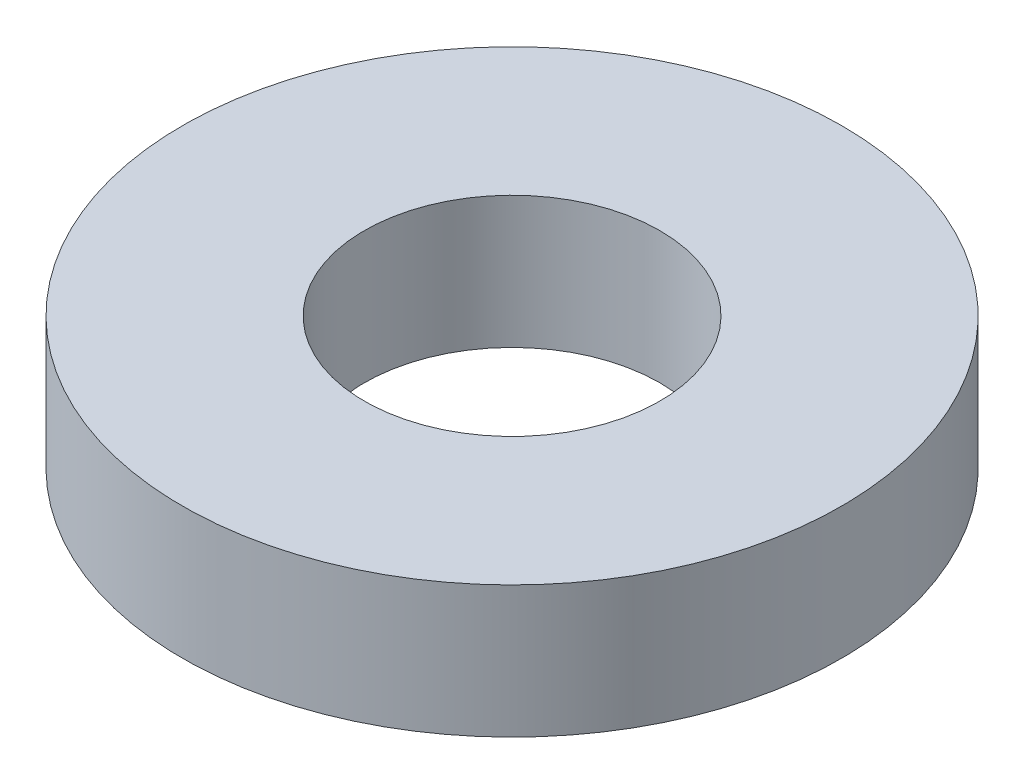
ISO-10303-21;
HEADER;
FILE_DESCRIPTION(('STEP AP214'),'2;1');
FILE_NAME('part.step','',(''),(''),'','','');
FILE_SCHEMA(('AUTOMOTIVE_DESIGN { 1 0 10303 214 1 1 1 1 }'));
ENDSEC;
DATA;
#1=APPLICATION_CONTEXT('core data for automotive mechanical design processes');
#2=APPLICATION_PROTOCOL_DEFINITION('international standard','automotive_design',2000,#1);
#3=PRODUCT_CONTEXT('',#1,'mechanical');
#4=PRODUCT('Part','Part','',(#3));
#5=PRODUCT_RELATED_PRODUCT_CATEGORY('part','',(#4));
#6=PRODUCT_DEFINITION_FORMATION('','',#4);
#7=PRODUCT_DEFINITION_CONTEXT('part definition',#1,'design');
#8=PRODUCT_DEFINITION('design','',#6,#7);
#9=PRODUCT_DEFINITION_SHAPE('','',#8);
#10=(LENGTH_UNIT() NAMED_UNIT(*) SI_UNIT(.MILLI.,.METRE.));
#11=(NAMED_UNIT(*) PLANE_ANGLE_UNIT() SI_UNIT($,.RADIAN.));
#12=(NAMED_UNIT(*) SI_UNIT($,.STERADIAN.) SOLID_ANGLE_UNIT());
#13=UNCERTAINTY_MEASURE_WITH_UNIT(LENGTH_MEASURE(1.E-05),#10,'distance_accuracy_value','');
#14=(GEOMETRIC_REPRESENTATION_CONTEXT(3) GLOBAL_UNCERTAINTY_ASSIGNED_CONTEXT((#13)) GLOBAL_UNIT_ASSIGNED_CONTEXT((#10,
#11,#12)) REPRESENTATION_CONTEXT('',''));
#15=CARTESIAN_POINT('',(0.,0.,0.));
#16=DIRECTION('',(0.,0.,1.));
#17=DIRECTION('',(1.,0.,0.));
#18=AXIS2_PLACEMENT_3D('',#15,#16,#17);
#19=CARTESIAN_POINT('',(0.,29.,0.));
#20=DIRECTION('',(0.,-1.,0.));
#21=DIRECTION('',(0.,0.,-1.));
#22=AXIS2_PLACEMENT_3D('',#19,#20,#21);
#23=CYLINDRICAL_SURFACE('',#22,72.5);
#24=CARTESIAN_POINT('',(0.,29.,0.));
#25=DIRECTION('',(0.,1.,0.));
#26=DIRECTION('',(0.,0.,1.));
#27=AXIS2_PLACEMENT_3D('',#24,#25,#26);
#28=CIRCLE('',#27,72.5);
#29=CARTESIAN_POINT('',(0.,29.,-72.5));
#30=VERTEX_POINT('',#29);
#31=EDGE_CURVE('E10',#30,#30,#28,.T.);
#32=CARTESIAN_POINT('',(0.,0.,0.));
#33=DIRECTION('',(0.,1.,0.));
#34=DIRECTION('',(0.,0.,1.));
#35=AXIS2_PLACEMENT_3D('',#32,#33,#34);
#36=CIRCLE('',#35,72.5);
#37=CARTESIAN_POINT('',(0.,0.,-72.5));
#38=VERTEX_POINT('',#37);
#39=EDGE_CURVE('E37',#38,#38,#36,.T.);
#40=CARTESIAN_POINT('',(0.,29.,-72.5));
#41=CARTESIAN_POINT('',(0.,28.6979166666667,-72.5));
#42=CARTESIAN_POINT('',(0.,28.3958333333333,-72.5));
#43=CARTESIAN_POINT('',(0.,27.7916666666667,-72.5));
#44=CARTESIAN_POINT('',(0.,27.4895833333333,-72.5));
#45=CARTESIAN_POINT('',(0.,26.8854166666667,-72.5));
#46=CARTESIAN_POINT('',(0.,26.5833333333333,-72.5));
#47=CARTESIAN_POINT('',(0.,25.9791666666667,-72.5));
#48=CARTESIAN_POINT('',(0.,25.6770833333333,-72.5));
#49=CARTESIAN_POINT('',(0.,25.0729166666667,-72.5));
#50=CARTESIAN_POINT('',(0.,24.7708333333333,-72.5));
#51=CARTESIAN_POINT('',(0.,24.1666666666667,-72.5));
#52=CARTESIAN_POINT('',(0.,23.8645833333333,-72.5));
#53=CARTESIAN_POINT('',(0.,23.2604166666667,-72.5));
#54=CARTESIAN_POINT('',(0.,22.9583333333333,-72.5));
#55=CARTESIAN_POINT('',(0.,22.3541666666667,-72.5));
#56=CARTESIAN_POINT('',(0.,22.0520833333333,-72.5));
#57=CARTESIAN_POINT('',(0.,21.4479166666667,-72.5));
#58=CARTESIAN_POINT('',(0.,21.1458333333333,-72.5));
#59=CARTESIAN_POINT('',(0.,20.5416666666667,-72.5));
#60=CARTESIAN_POINT('',(0.,20.2395833333333,-72.5));
#61=CARTESIAN_POINT('',(0.,19.6354166666667,-72.5));
#62=CARTESIAN_POINT('',(0.,19.3333333333333,-72.5));
#63=CARTESIAN_POINT('',(0.,18.7291666666667,-72.5));
#64=CARTESIAN_POINT('',(0.,18.4270833333333,-72.5));
#65=CARTESIAN_POINT('',(0.,17.8229166666667,-72.5));
#66=CARTESIAN_POINT('',(0.,17.5208333333333,-72.5));
#67=CARTESIAN_POINT('',(0.,16.9166666666667,-72.5));
#68=CARTESIAN_POINT('',(0.,16.6145833333333,-72.5));
#69=CARTESIAN_POINT('',(0.,16.0104166666667,-72.5));
#70=CARTESIAN_POINT('',(0.,15.7083333333333,-72.5));
#71=CARTESIAN_POINT('',(0.,15.1041666666667,-72.5));
#72=CARTESIAN_POINT('',(0.,14.8020833333333,-72.5));
#73=CARTESIAN_POINT('',(0.,14.1979166666667,-72.5));
#74=CARTESIAN_POINT('',(0.,13.8958333333333,-72.5));
#75=CARTESIAN_POINT('',(0.,13.2916666666667,-72.5));
#76=CARTESIAN_POINT('',(0.,12.9895833333333,-72.5));
#77=CARTESIAN_POINT('',(0.,12.3854166666667,-72.5));
#78=CARTESIAN_POINT('',(0.,12.0833333333333,-72.5));
#79=CARTESIAN_POINT('',(0.,11.4791666666667,-72.5));
#80=CARTESIAN_POINT('',(0.,11.1770833333333,-72.5));
#81=CARTESIAN_POINT('',(0.,10.5729166666667,-72.5));
#82=CARTESIAN_POINT('',(0.,10.2708333333333,-72.5));
#83=CARTESIAN_POINT('',(0.,9.66666666666667,-72.5));
#84=CARTESIAN_POINT('',(0.,9.36458333333333,-72.5));
#85=CARTESIAN_POINT('',(0.,8.76041666666667,-72.5));
#86=CARTESIAN_POINT('',(0.,8.45833333333333,-72.5));
#87=CARTESIAN_POINT('',(0.,7.85416666666667,-72.5));
#88=CARTESIAN_POINT('',(0.,7.55208333333333,-72.5));
#89=CARTESIAN_POINT('',(0.,6.94791666666667,-72.5));
#90=CARTESIAN_POINT('',(0.,6.64583333333333,-72.5));
#91=CARTESIAN_POINT('',(0.,6.04166666666667,-72.5));
#92=CARTESIAN_POINT('',(0.,5.73958333333333,-72.5));
#93=CARTESIAN_POINT('',(0.,5.13541666666667,-72.5));
#94=CARTESIAN_POINT('',(0.,4.83333333333333,-72.5));
#95=CARTESIAN_POINT('',(0.,4.22916666666667,-72.5));
#96=CARTESIAN_POINT('',(0.,3.92708333333333,-72.5));
#97=CARTESIAN_POINT('',(0.,3.32291666666667,-72.5));
#98=CARTESIAN_POINT('',(0.,3.02083333333333,-72.5));
#99=CARTESIAN_POINT('',(0.,2.41666666666667,-72.5));
#100=CARTESIAN_POINT('',(0.,2.11458333333333,-72.5));
#101=CARTESIAN_POINT('',(0.,1.51041666666667,-72.5));
#102=CARTESIAN_POINT('',(0.,1.20833333333333,-72.5));
#103=CARTESIAN_POINT('',(0.,0.604166666666667,-72.5));
#104=CARTESIAN_POINT('',(0.,0.302083333333333,-72.5));
#105=CARTESIAN_POINT('',(0.,0.,-72.5));
#106=B_SPLINE_CURVE_WITH_KNOTS('',3,(#40,#41,#42,#43,#44,#45,#46,#47,#48,#49,#50,#51,#52,#53,
#54,#55,#56,#57,#58,#59,#60,#61,#62,#63,#64,#65,#66,#67,#68,#69,#70,#71,#72,#73,#74,#75,#76,#77,
#78,#79,#80,#81,#82,#83,#84,#85,#86,#87,#88,#89,#90,#91,#92,#93,#94,#95,#96,#97,#98,#99,#100,
#101,#102,#103,#104,#105),.UNSPECIFIED.,.F.,.F.,(4,2,2,2,2,2,2,2,2,2,2,2,2,2,2,2,2,2,2,2,2,2,2,
2,2,2,2,2,2,2,2,2,4),(0.,0.906249999999997,1.8125,2.71875,3.625,4.53125,5.4375,6.34375,7.25,
8.15625,9.0625,9.96875,10.875,11.78125,12.6875,13.59375,14.5,15.40625,16.3125,17.21875,18.125,
19.03125,19.9375,20.84375,21.75,22.65625,23.5625,24.46875,25.375,26.28125,27.1875,28.09375,29.),.UNSPECIFIED.);
#107=EDGE_CURVE('BSEAM40',#30,#38,#106,.T.);
#108=ORIENTED_EDGE('',*,*,#31,.F.);
#109=ORIENTED_EDGE('',*,*,#39,.T.);
#110=ORIENTED_EDGE('',*,*,#107,.T.);
#111=ORIENTED_EDGE('',*,*,#107,.F.);
#112=EDGE_LOOP('',(#108,#110,#109,#111));
#113=FACE_BOUND('',#112,.T.);
#114=ADVANCED_FACE('F40',(#113),#23,.T.);
#115=CARTESIAN_POINT('',(0.,29.,0.));
#116=DIRECTION('',(0.,1.,0.));
#117=DIRECTION('',(0.,0.,1.));
#118=AXIS2_PLACEMENT_3D('',#115,#116,#117);
#119=PLANE('',#118);
#120=CARTESIAN_POINT('',(0.,29.,0.));
#121=DIRECTION('',(0.,1.,0.));
#122=DIRECTION('',(0.,0.,1.));
#123=AXIS2_PLACEMENT_3D('',#120,#121,#122);
#124=CIRCLE('',#123,32.5);
#125=CARTESIAN_POINT('',(0.,29.,-32.5));
#126=VERTEX_POINT('',#125);
#127=EDGE_CURVE('E50',#126,#126,#124,.T.);
#128=ORIENTED_EDGE('',*,*,#127,.F.);
#129=EDGE_LOOP('',(#128));
#130=FACE_BOUND('',#129,.T.);
#131=ORIENTED_EDGE('',*,*,#31,.T.);
#132=EDGE_LOOP('',(#131));
#133=FACE_BOUND('',#132,.T.);
#134=ADVANCED_FACE('F59',(#130,#133),#119,.T.);
#135=CARTESIAN_POINT('',(0.,0.,0.));
#136=DIRECTION('',(0.,1.,0.));
#137=DIRECTION('',(0.,0.,1.));
#138=AXIS2_PLACEMENT_3D('',#135,#136,#137);
#139=PLANE('',#138);
#140=CARTESIAN_POINT('',(0.,0.,0.));
#141=DIRECTION('',(0.,1.,0.));
#142=DIRECTION('',(0.,0.,1.));
#143=AXIS2_PLACEMENT_3D('',#140,#141,#142);
#144=CIRCLE('',#143,32.5);
#145=CARTESIAN_POINT('',(0.,0.,-32.5));
#146=VERTEX_POINT('',#145);
#147=EDGE_CURVE('E47',#146,#146,#144,.T.);
#148=ORIENTED_EDGE('',*,*,#147,.T.);
#149=EDGE_LOOP('',(#148));
#150=FACE_BOUND('',#149,.T.);
#151=ORIENTED_EDGE('',*,*,#39,.F.);
#152=EDGE_LOOP('',(#151));
#153=FACE_BOUND('',#152,.T.);
#154=ADVANCED_FACE('F58',(#150,#153),#139,.F.);
#155=CARTESIAN_POINT('',(0.,29.,0.));
#156=DIRECTION('',(0.,-1.,0.));
#157=DIRECTION('',(0.,0.,-1.));
#158=AXIS2_PLACEMENT_3D('',#155,#156,#157);
#159=CYLINDRICAL_SURFACE('',#158,32.5);
#160=CARTESIAN_POINT('',(0.,29.,-32.5));
#161=CARTESIAN_POINT('',(0.,28.6979166666667,-32.5));
#162=CARTESIAN_POINT('',(0.,28.3958333333333,-32.5));
#163=CARTESIAN_POINT('',(0.,27.7916666666667,-32.5));
#164=CARTESIAN_POINT('',(0.,27.4895833333333,-32.5));
#165=CARTESIAN_POINT('',(0.,26.8854166666667,-32.5));
#166=CARTESIAN_POINT('',(0.,26.5833333333333,-32.5));
#167=CARTESIAN_POINT('',(0.,25.9791666666667,-32.5));
#168=CARTESIAN_POINT('',(0.,25.6770833333333,-32.5));
#169=CARTESIAN_POINT('',(0.,25.0729166666667,-32.5));
#170=CARTESIAN_POINT('',(0.,24.7708333333333,-32.5));
#171=CARTESIAN_POINT('',(0.,24.1666666666667,-32.5));
#172=CARTESIAN_POINT('',(0.,23.8645833333333,-32.5));
#173=CARTESIAN_POINT('',(0.,23.2604166666667,-32.5));
#174=CARTESIAN_POINT('',(0.,22.9583333333333,-32.5));
#175=CARTESIAN_POINT('',(0.,22.3541666666667,-32.5));
#176=CARTESIAN_POINT('',(0.,22.0520833333333,-32.5));
#177=CARTESIAN_POINT('',(0.,21.4479166666667,-32.5));
#178=CARTESIAN_POINT('',(0.,21.1458333333333,-32.5));
#179=CARTESIAN_POINT('',(0.,20.5416666666667,-32.5));
#180=CARTESIAN_POINT('',(0.,20.2395833333333,-32.5));
#181=CARTESIAN_POINT('',(0.,19.6354166666667,-32.5));
#182=CARTESIAN_POINT('',(0.,19.3333333333333,-32.5));
#183=CARTESIAN_POINT('',(0.,18.7291666666667,-32.5));
#184=CARTESIAN_POINT('',(0.,18.4270833333333,-32.5));
#185=CARTESIAN_POINT('',(0.,17.8229166666667,-32.5));
#186=CARTESIAN_POINT('',(0.,17.5208333333333,-32.5));
#187=CARTESIAN_POINT('',(0.,16.9166666666667,-32.5));
#188=CARTESIAN_POINT('',(0.,16.6145833333333,-32.5));
#189=CARTESIAN_POINT('',(0.,16.0104166666667,-32.5));
#190=CARTESIAN_POINT('',(0.,15.7083333333333,-32.5));
#191=CARTESIAN_POINT('',(0.,15.1041666666667,-32.5));
#192=CARTESIAN_POINT('',(0.,14.8020833333333,-32.5));
#193=CARTESIAN_POINT('',(0.,14.1979166666667,-32.5));
#194=CARTESIAN_POINT('',(0.,13.8958333333333,-32.5));
#195=CARTESIAN_POINT('',(0.,13.2916666666667,-32.5));
#196=CARTESIAN_POINT('',(0.,12.9895833333333,-32.5));
#197=CARTESIAN_POINT('',(0.,12.3854166666667,-32.5));
#198=CARTESIAN_POINT('',(0.,12.0833333333333,-32.5));
#199=CARTESIAN_POINT('',(0.,11.4791666666667,-32.5));
#200=CARTESIAN_POINT('',(0.,11.1770833333333,-32.5));
#201=CARTESIAN_POINT('',(0.,10.5729166666667,-32.5));
#202=CARTESIAN_POINT('',(0.,10.2708333333333,-32.5));
#203=CARTESIAN_POINT('',(0.,9.66666666666667,-32.5));
#204=CARTESIAN_POINT('',(0.,9.36458333333333,-32.5));
#205=CARTESIAN_POINT('',(0.,8.76041666666667,-32.5));
#206=CARTESIAN_POINT('',(0.,8.45833333333333,-32.5));
#207=CARTESIAN_POINT('',(0.,7.85416666666667,-32.5));
#208=CARTESIAN_POINT('',(0.,7.55208333333333,-32.5));
#209=CARTESIAN_POINT('',(0.,6.94791666666667,-32.5));
#210=CARTESIAN_POINT('',(0.,6.64583333333333,-32.5));
#211=CARTESIAN_POINT('',(0.,6.04166666666667,-32.5));
#212=CARTESIAN_POINT('',(0.,5.73958333333333,-32.5));
#213=CARTESIAN_POINT('',(0.,5.13541666666667,-32.5));
#214=CARTESIAN_POINT('',(0.,4.83333333333333,-32.5));
#215=CARTESIAN_POINT('',(0.,4.22916666666667,-32.5));
#216=CARTESIAN_POINT('',(0.,3.92708333333333,-32.5));
#217=CARTESIAN_POINT('',(0.,3.32291666666667,-32.5));
#218=CARTESIAN_POINT('',(0.,3.02083333333333,-32.5));
#219=CARTESIAN_POINT('',(0.,2.41666666666667,-32.5));
#220=CARTESIAN_POINT('',(0.,2.11458333333333,-32.5));
#221=CARTESIAN_POINT('',(0.,1.51041666666667,-32.5));
#222=CARTESIAN_POINT('',(0.,1.20833333333333,-32.5));
#223=CARTESIAN_POINT('',(0.,0.604166666666667,-32.5));
#224=CARTESIAN_POINT('',(0.,0.302083333333333,-32.5));
#225=CARTESIAN_POINT('',(0.,0.,-32.5));
#226=B_SPLINE_CURVE_WITH_KNOTS('',3,(#160,#161,#162,#163,#164,#165,#166,#167,#168,#169,#170,
#171,#172,#173,#174,#175,#176,#177,#178,#179,#180,#181,#182,#183,#184,#185,#186,#187,#188,#189,
#190,#191,#192,#193,#194,#195,#196,#197,#198,#199,#200,#201,#202,#203,#204,#205,#206,#207,#208,
#209,#210,#211,#212,#213,#214,#215,#216,#217,#218,#219,#220,#221,#222,#223,#224,#225),
.UNSPECIFIED.,.F.,.F.,(4,2,2,2,2,2,2,2,2,2,2,2,2,2,2,2,2,2,2,2,2,2,2,2,2,2,2,2,2,2,2,2,4),(0.,
0.906249999999997,1.8125,2.71875,3.625,4.53125,5.4375,6.34375,7.25,8.15625,9.0625,9.96875,
10.875,11.78125,12.6875,13.59375,14.5,15.40625,16.3125,17.21875,18.125,19.03125,19.9375,
20.84375,21.75,22.65625,23.5625,24.46875,25.375,26.28125,27.1875,28.09375,29.),.UNSPECIFIED.);
#227=EDGE_CURVE('BSEAM54',#126,#146,#226,.T.);
#228=ORIENTED_EDGE('',*,*,#127,.T.);
#229=ORIENTED_EDGE('',*,*,#147,.F.);
#230=ORIENTED_EDGE('',*,*,#227,.T.);
#231=ORIENTED_EDGE('',*,*,#227,.F.);
#232=EDGE_LOOP('',(#228,#230,#229,#231));
#233=FACE_BOUND('',#232,.T.);
#234=ADVANCED_FACE('F54',(#233),#159,.F.);
#235=CLOSED_SHELL('',(#114,#134,#154,#234));
#236=MANIFOLD_SOLID_BREP('B2',#235);
#237=ADVANCED_BREP_SHAPE_REPRESENTATION('',(#18,#236),#14);
#238=SHAPE_DEFINITION_REPRESENTATION(#9,#237);
ENDSEC;
END-ISO-10303-21;
